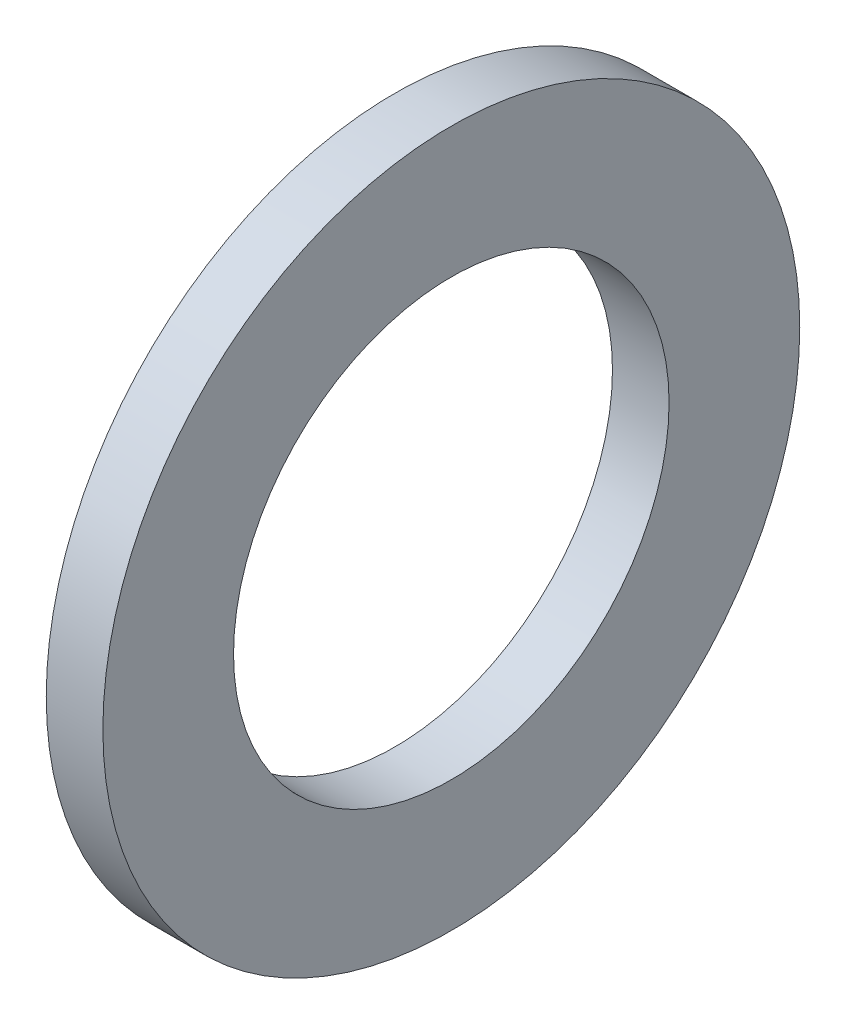
ISO-10303-21;
HEADER;
FILE_DESCRIPTION(('STEP AP214'),'2;1');
FILE_NAME('part.step','',(''),(''),'','','');
FILE_SCHEMA(('AUTOMOTIVE_DESIGN { 1 0 10303 214 1 1 1 1 }'));
ENDSEC;
DATA;
#1=APPLICATION_CONTEXT('core data for automotive mechanical design processes');
#2=APPLICATION_PROTOCOL_DEFINITION('international standard','automotive_design',2000,#1);
#3=PRODUCT_CONTEXT('',#1,'mechanical');
#4=PRODUCT('Part','Part','',(#3));
#5=PRODUCT_RELATED_PRODUCT_CATEGORY('part','',(#4));
#6=PRODUCT_DEFINITION_FORMATION('','',#4);
#7=PRODUCT_DEFINITION_CONTEXT('part definition',#1,'design');
#8=PRODUCT_DEFINITION('design','',#6,#7);
#9=PRODUCT_DEFINITION_SHAPE('','',#8);
#10=(LENGTH_UNIT() NAMED_UNIT(*) SI_UNIT(.MILLI.,.METRE.));
#11=(NAMED_UNIT(*) PLANE_ANGLE_UNIT() SI_UNIT($,.RADIAN.));
#12=(NAMED_UNIT(*) SI_UNIT($,.STERADIAN.) SOLID_ANGLE_UNIT());
#13=UNCERTAINTY_MEASURE_WITH_UNIT(LENGTH_MEASURE(1.E-05),#10,'distance_accuracy_value','');
#14=(GEOMETRIC_REPRESENTATION_CONTEXT(3) GLOBAL_UNCERTAINTY_ASSIGNED_CONTEXT((#13)) GLOBAL_UNIT_ASSIGNED_CONTEXT((#10,
#11,#12)) REPRESENTATION_CONTEXT('',''));
#15=CARTESIAN_POINT('',(0.,0.,0.));
#16=DIRECTION('',(0.,0.,1.));
#17=DIRECTION('',(1.,0.,0.));
#18=AXIS2_PLACEMENT_3D('',#15,#16,#17);
#19=CARTESIAN_POINT('',(1.651,0.,0.));
#20=DIRECTION('',(1.,0.,0.));
#21=DIRECTION('',(0.,0.,-1.));
#22=AXIS2_PLACEMENT_3D('',#19,#20,#21);
#23=PLANE('',#22);
#24=CARTESIAN_POINT('',(1.651,0.,0.));
#25=DIRECTION('',(1.,0.,0.));
#26=DIRECTION('',(0.,0.,-1.));
#27=AXIS2_PLACEMENT_3D('',#24,#25,#26);
#28=CIRCLE('',#27,10.16);
#29=CARTESIAN_POINT('',(1.651,0.,-10.16));
#30=VERTEX_POINT('',#29);
#31=EDGE_CURVE('E10',#30,#30,#28,.T.);
#32=ORIENTED_EDGE('',*,*,#31,.T.);
#33=EDGE_LOOP('',(#32));
#34=FACE_BOUND('',#33,.T.);
#35=CARTESIAN_POINT('',(1.651,0.,0.));
#36=DIRECTION('',(1.,0.,0.));
#37=DIRECTION('',(0.,0.,-1.));
#38=AXIS2_PLACEMENT_3D('',#35,#36,#37);
#39=CIRCLE('',#38,6.35);
#40=CARTESIAN_POINT('',(1.651,0.,-6.35));
#41=VERTEX_POINT('',#40);
#42=EDGE_CURVE('E42',#41,#41,#39,.T.);
#43=ORIENTED_EDGE('',*,*,#42,.F.);
#44=EDGE_LOOP('',(#43));
#45=FACE_BOUND('',#44,.T.);
#46=ADVANCED_FACE('F31',(#34,#45),#23,.T.);
#47=CARTESIAN_POINT('',(0.,0.,0.));
#48=DIRECTION('',(1.,0.,0.));
#49=DIRECTION('',(0.,0.,-1.));
#50=AXIS2_PLACEMENT_3D('',#47,#48,#49);
#51=PLANE('',#50);
#52=CARTESIAN_POINT('',(0.,0.,0.));
#53=DIRECTION('',(1.,0.,0.));
#54=DIRECTION('',(0.,0.,-1.));
#55=AXIS2_PLACEMENT_3D('',#52,#53,#54);
#56=CIRCLE('',#55,10.16);
#57=CARTESIAN_POINT('',(0.,0.,-10.16));
#58=VERTEX_POINT('',#57);
#59=EDGE_CURVE('E35',#58,#58,#56,.T.);
#60=ORIENTED_EDGE('',*,*,#59,.F.);
#61=EDGE_LOOP('',(#60));
#62=FACE_BOUND('',#61,.T.);
#63=CARTESIAN_POINT('',(0.,0.,0.));
#64=DIRECTION('',(1.,0.,0.));
#65=DIRECTION('',(0.,0.,-1.));
#66=AXIS2_PLACEMENT_3D('',#63,#64,#65);
#67=CIRCLE('',#66,6.35);
#68=CARTESIAN_POINT('',(0.,0.,-6.35));
#69=VERTEX_POINT('',#68);
#70=EDGE_CURVE('E44',#69,#69,#67,.T.);
#71=ORIENTED_EDGE('',*,*,#70,.T.);
#72=EDGE_LOOP('',(#71));
#73=FACE_BOUND('',#72,.T.);
#74=ADVANCED_FACE('F54',(#62,#73),#51,.F.);
#75=CARTESIAN_POINT('',(1.651,0.,0.));
#76=DIRECTION('',(-1.,0.,0.));
#77=DIRECTION('',(0.,0.,1.));
#78=AXIS2_PLACEMENT_3D('',#75,#76,#77);
#79=CYLINDRICAL_SURFACE('',#78,10.16);
#80=ORIENTED_EDGE('',*,*,#31,.F.);
#81=EDGE_LOOP('',(#80));
#82=FACE_BOUND('',#81,.T.);
#83=ORIENTED_EDGE('',*,*,#59,.T.);
#84=EDGE_LOOP('',(#83));
#85=FACE_BOUND('',#84,.T.);
#86=ADVANCED_FACE('F33',(#82,#85),#79,.T.);
#87=CARTESIAN_POINT('',(1.651,0.,0.));
#88=DIRECTION('',(-1.,0.,0.));
#89=DIRECTION('',(0.,0.,1.));
#90=AXIS2_PLACEMENT_3D('',#87,#88,#89);
#91=CYLINDRICAL_SURFACE('',#90,6.35);
#92=ORIENTED_EDGE('',*,*,#42,.T.);
#93=EDGE_LOOP('',(#92));
#94=FACE_BOUND('',#93,.T.);
#95=ORIENTED_EDGE('',*,*,#70,.F.);
#96=EDGE_LOOP('',(#95));
#97=FACE_BOUND('',#96,.T.);
#98=ADVANCED_FACE('F50',(#94,#97),#91,.F.);
#99=CLOSED_SHELL('',(#46,#74,#86,#98));
#100=MANIFOLD_SOLID_BREP('B2',#99);
#101=ADVANCED_BREP_SHAPE_REPRESENTATION('',(#18,#100),#14);
#102=SHAPE_DEFINITION_REPRESENTATION(#9,#101);
ENDSEC;
END-ISO-10303-21;
